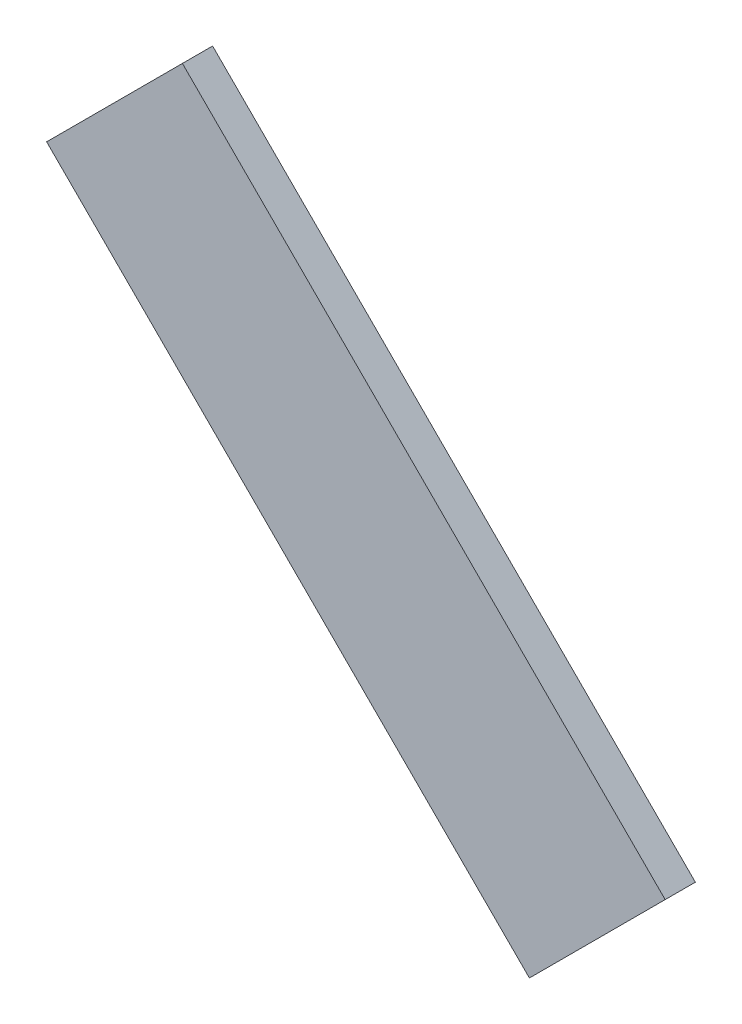
ISO-10303-21;
HEADER;
FILE_DESCRIPTION(('STEP AP214'),'2;1');
FILE_NAME('part.step','',(''),(''),'','','');
FILE_SCHEMA(('AUTOMOTIVE_DESIGN { 1 0 10303 214 1 1 1 1 }'));
ENDSEC;
DATA;
#1=APPLICATION_CONTEXT('core data for automotive mechanical design processes');
#2=APPLICATION_PROTOCOL_DEFINITION('international standard','automotive_design',2000,#1);
#3=PRODUCT_CONTEXT('',#1,'mechanical');
#4=PRODUCT('Part','Part','',(#3));
#5=PRODUCT_RELATED_PRODUCT_CATEGORY('part','',(#4));
#6=PRODUCT_DEFINITION_FORMATION('','',#4);
#7=PRODUCT_DEFINITION_CONTEXT('part definition',#1,'design');
#8=PRODUCT_DEFINITION('design','',#6,#7);
#9=PRODUCT_DEFINITION_SHAPE('','',#8);
#10=(LENGTH_UNIT() NAMED_UNIT(*) SI_UNIT(.MILLI.,.METRE.));
#11=(NAMED_UNIT(*) PLANE_ANGLE_UNIT() SI_UNIT($,.RADIAN.));
#12=(NAMED_UNIT(*) SI_UNIT($,.STERADIAN.) SOLID_ANGLE_UNIT());
#13=UNCERTAINTY_MEASURE_WITH_UNIT(LENGTH_MEASURE(1.E-05),#10,'distance_accuracy_value','');
#14=(GEOMETRIC_REPRESENTATION_CONTEXT(3) GLOBAL_UNCERTAINTY_ASSIGNED_CONTEXT((#13)) GLOBAL_UNIT_ASSIGNED_CONTEXT((#10,
#11,#12)) REPRESENTATION_CONTEXT('',''));
#15=CARTESIAN_POINT('',(0.,0.,0.));
#16=DIRECTION('',(0.,0.,1.));
#17=DIRECTION('',(1.,0.,0.));
#18=AXIS2_PLACEMENT_3D('',#15,#16,#17);
#19=CARTESIAN_POINT('',(-0.1149985,0.20500086,0.));
#20=DIRECTION('',(0.,0.,1.));
#21=DIRECTION('',(1.,0.,0.));
#22=AXIS2_PLACEMENT_3D('',#19,#20,#21);
#23=PLANE('',#22);
#24=DIRECTION('',(0.707106781186548,0.707106781186548,0.));
#25=VECTOR('',#24,1.);
#26=CARTESIAN_POINT('',(0.11500104,-0.20499832,0.));
#27=LINE('',#26,#25);
#28=CARTESIAN_POINT('',(0.11500104,-0.20499832,0.));
#29=VERTEX_POINT('',#28);
#30=CARTESIAN_POINT('',(0.20500086,-0.1149985,0.));
#31=VERTEX_POINT('',#30);
#32=EDGE_CURVE('E59',#29,#31,#27,.T.);
#33=ORIENTED_EDGE('',*,*,#32,.F.);
#34=DIRECTION('',(0.707106781186548,-0.707106781186548,0.));
#35=VECTOR('',#34,1.);
#36=CARTESIAN_POINT('',(-0.20499832,0.11500104,0.));
#37=LINE('',#36,#35);
#38=CARTESIAN_POINT('',(-0.20499832,0.11500104,0.));
#39=VERTEX_POINT('',#38);
#40=EDGE_CURVE('E53',#39,#29,#37,.T.);
#41=ORIENTED_EDGE('',*,*,#40,.F.);
#42=DIRECTION('',(-0.707106781186548,-0.707106781186548,0.));
#43=VECTOR('',#42,1.);
#44=CARTESIAN_POINT('',(-0.1149985,0.20500086,0.));
#45=LINE('',#44,#43);
#46=CARTESIAN_POINT('',(-0.1149985,0.20500086,0.));
#47=VERTEX_POINT('',#46);
#48=EDGE_CURVE('E56',#47,#39,#45,.T.);
#49=ORIENTED_EDGE('',*,*,#48,.F.);
#50=DIRECTION('',(-0.707106781186548,0.707106781186548,0.));
#51=VECTOR('',#50,1.);
#52=CARTESIAN_POINT('',(0.20500086,-0.1149985,0.));
#53=LINE('',#52,#51);
#54=EDGE_CURVE('E11',#31,#47,#53,.T.);
#55=ORIENTED_EDGE('',*,*,#54,.F.);
#56=EDGE_LOOP('',(#33,#41,#49,#55));
#57=FACE_BOUND('',#56,.T.);
#58=ADVANCED_FACE('F17',(#57),#23,.F.);
#59=CARTESIAN_POINT('',(-0.1149985,0.20500086,0.));
#60=DIRECTION('',(0.707106781186548,0.707106781186548,0.));
#61=DIRECTION('',(0.,0.,-1.));
#62=AXIS2_PLACEMENT_3D('',#59,#60,#61);
#63=PLANE('',#62);
#64=DIRECTION('',(0.,0.,-1.));
#65=VECTOR('',#64,1.);
#66=CARTESIAN_POINT('',(0.20500086,-0.1149985,0.));
#67=LINE('',#66,#65);
#68=CARTESIAN_POINT('',(0.20500086,-0.1149985,0.02));
#69=VERTEX_POINT('',#68);
#70=EDGE_CURVE('E26',#69,#31,#67,.T.);
#71=ORIENTED_EDGE('',*,*,#70,.T.);
#72=ORIENTED_EDGE('',*,*,#54,.T.);
#73=DIRECTION('',(0.,0.,1.));
#74=VECTOR('',#73,1.);
#75=CARTESIAN_POINT('',(-0.1149985,0.20500086,0.));
#76=LINE('',#75,#74);
#77=CARTESIAN_POINT('',(-0.1149985,0.20500086,0.02));
#78=VERTEX_POINT('',#77);
#79=EDGE_CURVE('E78',#47,#78,#76,.T.);
#80=ORIENTED_EDGE('',*,*,#79,.T.);
#81=DIRECTION('',(0.707106781186548,-0.707106781186548,0.));
#82=VECTOR('',#81,1.);
#83=CARTESIAN_POINT('',(-0.1149985,0.20500086,0.02));
#84=LINE('',#83,#82);
#85=EDGE_CURVE('E99',#78,#69,#84,.T.);
#86=ORIENTED_EDGE('',*,*,#85,.T.);
#87=EDGE_LOOP('',(#71,#72,#80,#86));
#88=FACE_BOUND('',#87,.T.);
#89=ADVANCED_FACE('F96',(#88),#63,.T.);
#90=CARTESIAN_POINT('',(0.20500086,-0.1149985,0.));
#91=DIRECTION('',(0.707106781186048,-0.707106781187048,0.));
#92=DIRECTION('',(0.,0.,-1.));
#93=AXIS2_PLACEMENT_3D('',#90,#91,#92);
#94=PLANE('',#93);
#95=DIRECTION('',(0.,0.,-1.));
#96=VECTOR('',#95,1.);
#97=CARTESIAN_POINT('',(0.11500104,-0.20499832,0.));
#98=LINE('',#97,#96);
#99=CARTESIAN_POINT('',(0.11500104,-0.20499832,0.02));
#100=VERTEX_POINT('',#99);
#101=EDGE_CURVE('E64',#100,#29,#98,.T.);
#102=ORIENTED_EDGE('',*,*,#101,.T.);
#103=ORIENTED_EDGE('',*,*,#32,.T.);
#104=ORIENTED_EDGE('',*,*,#70,.F.);
#105=DIRECTION('',(-0.707106781187048,-0.707106781186048,0.));
#106=VECTOR('',#105,1.);
#107=CARTESIAN_POINT('',(0.20500086,-0.1149985,0.02));
#108=LINE('',#107,#106);
#109=EDGE_CURVE('E105',#69,#100,#108,.T.);
#110=ORIENTED_EDGE('',*,*,#109,.T.);
#111=EDGE_LOOP('',(#102,#103,#104,#110));
#112=FACE_BOUND('',#111,.T.);
#113=ADVANCED_FACE('F103',(#112),#94,.T.);
#114=CARTESIAN_POINT('',(0.11500104,-0.20499832,0.));
#115=DIRECTION('',(-0.707106781186548,-0.707106781186548,0.));
#116=DIRECTION('',(-0.707106781186548,0.707106781186548,0.));
#117=AXIS2_PLACEMENT_3D('',#114,#115,#116);
#118=PLANE('',#117);
#119=DIRECTION('',(0.,0.,-1.));
#120=VECTOR('',#119,1.);
#121=CARTESIAN_POINT('',(-0.20499832,0.11500104,0.));
#122=LINE('',#121,#120);
#123=CARTESIAN_POINT('',(-0.20499832,0.11500104,0.02));
#124=VERTEX_POINT('',#123);
#125=EDGE_CURVE('E65',#124,#39,#122,.T.);
#126=ORIENTED_EDGE('',*,*,#125,.T.);
#127=ORIENTED_EDGE('',*,*,#40,.T.);
#128=ORIENTED_EDGE('',*,*,#101,.F.);
#129=DIRECTION('',(-0.707106781186548,0.707106781186548,0.));
#130=VECTOR('',#129,1.);
#131=CARTESIAN_POINT('',(0.11500104,-0.20499832,0.02));
#132=LINE('',#131,#130);
#133=EDGE_CURVE('E70',#100,#124,#132,.T.);
#134=ORIENTED_EDGE('',*,*,#133,.T.);
#135=EDGE_LOOP('',(#126,#127,#128,#134));
#136=FACE_BOUND('',#135,.T.);
#137=ADVANCED_FACE('F68',(#136),#118,.T.);
#138=CARTESIAN_POINT('',(-0.20499832,0.11500104,0.));
#139=DIRECTION('',(-0.707106781187048,0.707106781186048,0.));
#140=DIRECTION('',(0.,0.,1.));
#141=AXIS2_PLACEMENT_3D('',#138,#139,#140);
#142=PLANE('',#141);
#143=ORIENTED_EDGE('',*,*,#79,.F.);
#144=ORIENTED_EDGE('',*,*,#48,.T.);
#145=ORIENTED_EDGE('',*,*,#125,.F.);
#146=DIRECTION('',(0.707106781186048,0.707106781187048,0.));
#147=VECTOR('',#146,1.);
#148=CARTESIAN_POINT('',(-0.20499832,0.11500104,0.02));
#149=LINE('',#148,#147);
#150=EDGE_CURVE('E176',#124,#78,#149,.T.);
#151=ORIENTED_EDGE('',*,*,#150,.T.);
#152=EDGE_LOOP('',(#143,#144,#145,#151));
#153=FACE_BOUND('',#152,.T.);
#154=ADVANCED_FACE('F76',(#153),#142,.T.);
#155=CARTESIAN_POINT('',(-0.1149985,0.20500086,0.02));
#156=DIRECTION('',(0.,0.,1.));
#157=DIRECTION('',(1.,0.,0.));
#158=AXIS2_PLACEMENT_3D('',#155,#156,#157);
#159=PLANE('',#158);
#160=ORIENTED_EDGE('',*,*,#109,.F.);
#161=ORIENTED_EDGE('',*,*,#85,.F.);
#162=ORIENTED_EDGE('',*,*,#150,.F.);
#163=ORIENTED_EDGE('',*,*,#133,.F.);
#164=EDGE_LOOP('',(#160,#161,#162,#163));
#165=FACE_BOUND('',#164,.T.);
#166=ADVANCED_FACE('F139',(#165),#159,.T.);
#167=CLOSED_SHELL('',(#58,#89,#113,#137,#154,#166));
#168=MANIFOLD_SOLID_BREP('B1',#167);
#169=ADVANCED_BREP_SHAPE_REPRESENTATION('',(#18,#168),#14);
#170=SHAPE_DEFINITION_REPRESENTATION(#9,#169);
ENDSEC;
END-ISO-10303-21;
